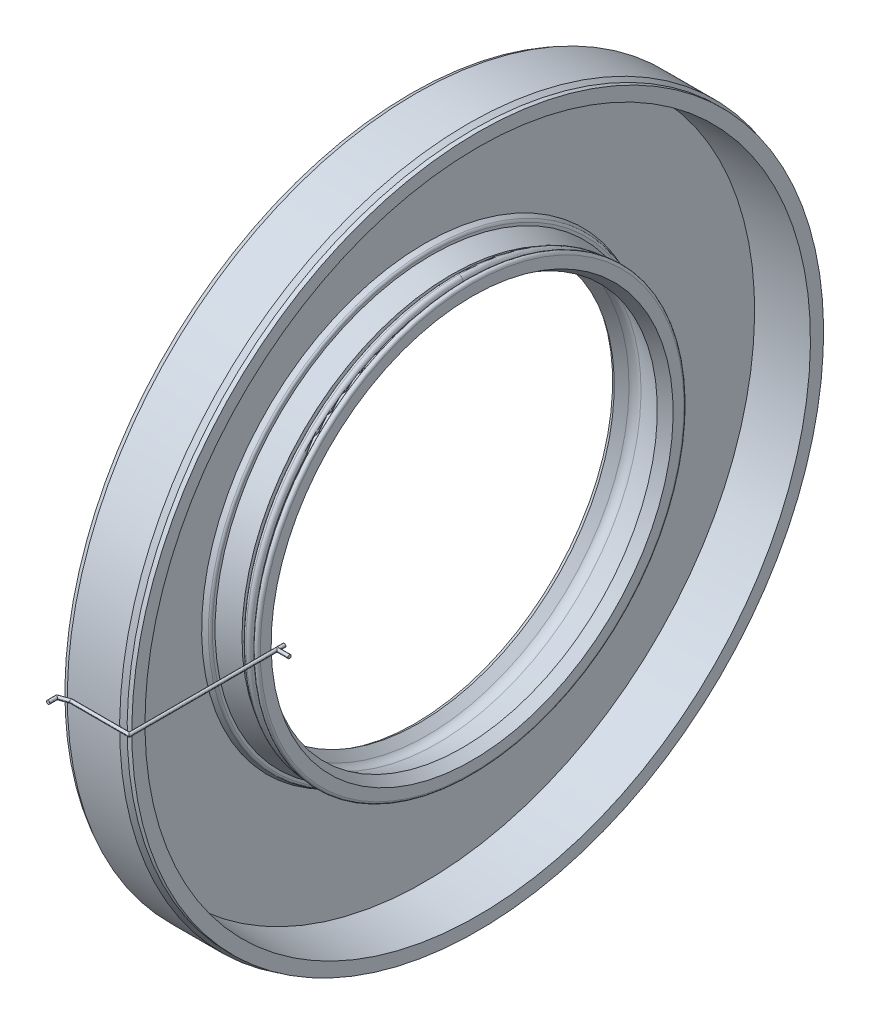
ISO-10303-21;
HEADER;
FILE_DESCRIPTION(('STEP AP214'),'2;1');
FILE_NAME('part.step','',(''),(''),'','','');
FILE_SCHEMA(('AUTOMOTIVE_DESIGN { 1 0 10303 214 1 1 1 1 }'));
ENDSEC;
DATA;
#1=APPLICATION_CONTEXT('core data for automotive mechanical design processes');
#2=APPLICATION_PROTOCOL_DEFINITION('international standard','automotive_design',2000,#1);
#3=PRODUCT_CONTEXT('',#1,'mechanical');
#4=PRODUCT('Part','Part','',(#3));
#5=PRODUCT_RELATED_PRODUCT_CATEGORY('part','',(#4));
#6=PRODUCT_DEFINITION_FORMATION('','',#4);
#7=PRODUCT_DEFINITION_CONTEXT('part definition',#1,'design');
#8=PRODUCT_DEFINITION('design','',#6,#7);
#9=PRODUCT_DEFINITION_SHAPE('','',#8);
#10=(LENGTH_UNIT() NAMED_UNIT(*) SI_UNIT(.MILLI.,.METRE.));
#11=(NAMED_UNIT(*) PLANE_ANGLE_UNIT() SI_UNIT($,.RADIAN.));
#12=(NAMED_UNIT(*) SI_UNIT($,.STERADIAN.) SOLID_ANGLE_UNIT());
#13=UNCERTAINTY_MEASURE_WITH_UNIT(LENGTH_MEASURE(1.E-05),#10,'distance_accuracy_value','');
#14=(GEOMETRIC_REPRESENTATION_CONTEXT(3) GLOBAL_UNCERTAINTY_ASSIGNED_CONTEXT((#13)) GLOBAL_UNIT_ASSIGNED_CONTEXT((#10,
#11,#12)) REPRESENTATION_CONTEXT('',''));
#15=CARTESIAN_POINT('',(0.,0.,0.));
#16=DIRECTION('',(0.,0.,1.));
#17=DIRECTION('',(1.,0.,0.));
#18=AXIS2_PLACEMENT_3D('',#15,#16,#17);
#19=CARTESIAN_POINT('',(-1.964337,38.001163,0.));
#20=DIRECTION('',(-1.,0.,0.));
#21=DIRECTION('',(0.,-1.,0.));
#22=AXIS2_PLACEMENT_3D('',#19,#20,#21);
#23=PLANE('',#22);
#24=CARTESIAN_POINT('',(-1.964337,0.,0.));
#25=DIRECTION('',(1.,0.,0.));
#26=DIRECTION('',(0.,1.,0.));
#27=AXIS2_PLACEMENT_3D('',#24,#25,#26);
#28=CIRCLE('',#27,37.566663);
#29=CARTESIAN_POINT('',(-1.964337,37.566663,0.));
#30=VERTEX_POINT('',#29);
#31=EDGE_CURVE('P0_E20',#30,#30,#28,.T.);
#32=ORIENTED_EDGE('',*,*,#31,.T.);
#33=EDGE_LOOP('',(#32));
#34=FACE_BOUND('',#33,.T.);
#35=CARTESIAN_POINT('',(-1.964337,0.,0.));
#36=DIRECTION('',(1.,0.,0.));
#37=DIRECTION('',(0.,1.,0.));
#38=AXIS2_PLACEMENT_3D('',#35,#36,#37);
#39=CIRCLE('',#38,38.001163);
#40=CARTESIAN_POINT('',(-1.964337,38.001163,0.));
#41=VERTEX_POINT('',#40);
#42=EDGE_CURVE('P0_E9',#41,#41,#39,.T.);
#43=ORIENTED_EDGE('',*,*,#42,.F.);
#44=EDGE_LOOP('',(#43));
#45=FACE_BOUND('',#44,.T.);
#46=ADVANCED_FACE('P0_F14',(#34,#45),#23,.T.);
#47=CARTESIAN_POINT('',(-3.339337,0.,0.));
#48=DIRECTION('',(1.,0.,0.));
#49=DIRECTION('',(0.,1.,0.));
#50=AXIS2_PLACEMENT_3D('',#47,#48,#49);
#51=TOROIDAL_SURFACE('',#50,37.566663,1.375);
#52=CARTESIAN_POINT('',(-4.714337,0.,0.));
#53=DIRECTION('',(1.,0.,0.));
#54=DIRECTION('',(0.,1.,0.));
#55=AXIS2_PLACEMENT_3D('',#52,#53,#54);
#56=CIRCLE('',#55,37.566663);
#57=CARTESIAN_POINT('',(-4.714337,37.566663,0.));
#58=VERTEX_POINT('',#57);
#59=EDGE_CURVE('P0_E24',#58,#58,#56,.T.);
#60=ORIENTED_EDGE('',*,*,#59,.T.);
#61=EDGE_LOOP('',(#60));
#62=FACE_BOUND('',#61,.T.);
#63=ORIENTED_EDGE('',*,*,#31,.F.);
#64=EDGE_LOOP('',(#63));
#65=FACE_BOUND('',#64,.T.);
#66=ADVANCED_FACE('P0_F122',(#62,#65),#51,.F.);
#67=CARTESIAN_POINT('',(-4.714337,0.,0.));
#68=DIRECTION('',(-1.,0.,0.));
#69=DIRECTION('',(0.,-1.,0.));
#70=AXIS2_PLACEMENT_3D('',#67,#68,#69);
#71=CONICAL_SURFACE('',#70,37.566663,0.327053895995008);
#72=CARTESIAN_POINT('',(-8.31960907968015,0.,0.));
#73=DIRECTION('',(1.,0.,0.));
#74=DIRECTION('',(0.,1.,0.));
#75=AXIS2_PLACEMENT_3D('',#72,#73,#74);
#76=CIRCLE('',#75,38.7897026144328);
#77=CARTESIAN_POINT('',(-8.31960907968015,38.7897026144328,0.));
#78=VERTEX_POINT('',#77);
#79=EDGE_CURVE('P0_E28',#78,#78,#76,.T.);
#80=ORIENTED_EDGE('',*,*,#79,.T.);
#81=EDGE_LOOP('',(#80));
#82=FACE_BOUND('',#81,.T.);
#83=ORIENTED_EDGE('',*,*,#59,.F.);
#84=EDGE_LOOP('',(#83));
#85=FACE_BOUND('',#84,.T.);
#86=ADVANCED_FACE('P0_F126',(#82,#85),#71,.T.);
#87=CARTESIAN_POINT('',(-8.31960907968015,39.2716858744327,0.));
#88=DIRECTION('',(1.,0.,0.));
#89=DIRECTION('',(0.,1.,0.));
#90=AXIS2_PLACEMENT_3D('',#87,#88,#89);
#91=PLANE('',#90);
#92=CARTESIAN_POINT('',(-8.31960907968015,0.,0.));
#93=DIRECTION('',(1.,0.,0.));
#94=DIRECTION('',(0.,1.,0.));
#95=AXIS2_PLACEMENT_3D('',#92,#93,#94);
#96=CIRCLE('',#95,39.2716858744327);
#97=CARTESIAN_POINT('',(-8.31960907968015,39.2716858744327,0.));
#98=VERTEX_POINT('',#97);
#99=EDGE_CURVE('P0_E33',#98,#98,#96,.T.);
#100=ORIENTED_EDGE('',*,*,#99,.T.);
#101=EDGE_LOOP('',(#100));
#102=FACE_BOUND('',#101,.T.);
#103=ORIENTED_EDGE('',*,*,#79,.F.);
#104=EDGE_LOOP('',(#103));
#105=FACE_BOUND('',#104,.T.);
#106=ADVANCED_FACE('P0_F132',(#102,#105),#91,.T.);
#107=CARTESIAN_POINT('',(-8.77794167968015,0.,0.));
#108=DIRECTION('',(1.,0.,0.));
#109=DIRECTION('',(0.,1.,0.));
#110=AXIS2_PLACEMENT_3D('',#107,#108,#109);
#111=TOROIDAL_SURFACE('',#110,39.2716858744327,0.4583326);
#112=CARTESIAN_POINT('',(-8.60576674,0.,0.));
#113=DIRECTION('',(1.,0.,0.));
#114=DIRECTION('',(0.,1.,0.));
#115=AXIS2_PLACEMENT_3D('',#112,#113,#114);
#116=CIRCLE('',#115,39.69645);
#117=CARTESIAN_POINT('',(-8.60576674,39.69645,0.));
#118=VERTEX_POINT('',#117);
#119=EDGE_CURVE('P0_E36',#118,#118,#116,.T.);
#120=ORIENTED_EDGE('',*,*,#119,.T.);
#121=EDGE_LOOP('',(#120));
#122=FACE_BOUND('',#121,.T.);
#123=ORIENTED_EDGE('',*,*,#99,.F.);
#124=EDGE_LOOP('',(#123));
#125=FACE_BOUND('',#124,.T.);
#126=ADVANCED_FACE('P0_F139',(#122,#125),#111,.T.);
#127=CARTESIAN_POINT('',(-8.60576674,0.,0.));
#128=DIRECTION('',(-1.,0.,0.));
#129=DIRECTION('',(0.,-1.,0.));
#130=AXIS2_PLACEMENT_3D('',#127,#128,#129);
#131=CONICAL_SURFACE('',#130,39.69645,0.385103453086037);
#132=CARTESIAN_POINT('',(-9.47,0.,0.));
#133=DIRECTION('',(1.,0.,0.));
#134=DIRECTION('',(0.,1.,0.));
#135=AXIS2_PLACEMENT_3D('',#132,#133,#134);
#136=CIRCLE('',#135,40.0467604439702);
#137=CARTESIAN_POINT('',(-9.47,40.0467604439702,0.));
#138=VERTEX_POINT('',#137);
#139=EDGE_CURVE('P0_E39',#138,#138,#136,.T.);
#140=ORIENTED_EDGE('',*,*,#139,.T.);
#141=EDGE_LOOP('',(#140));
#142=FACE_BOUND('',#141,.T.);
#143=ORIENTED_EDGE('',*,*,#119,.F.);
#144=EDGE_LOOP('',(#143));
#145=FACE_BOUND('',#144,.T.);
#146=ADVANCED_FACE('P0_F143',(#142,#145),#131,.T.);
#147=CARTESIAN_POINT('',(-9.47,59.1402501461873,0.));
#148=DIRECTION('',(1.,0.,0.));
#149=DIRECTION('',(0.,1.,0.));
#150=AXIS2_PLACEMENT_3D('',#147,#148,#149);
#151=PLANE('',#150);
#152=CARTESIAN_POINT('',(-9.47,0.,0.));
#153=DIRECTION('',(1.,0.,0.));
#154=DIRECTION('',(0.,1.,0.));
#155=AXIS2_PLACEMENT_3D('',#152,#153,#154);
#156=CIRCLE('',#155,59.1402501461873);
#157=CARTESIAN_POINT('',(-9.47,59.1402501461873,0.));
#158=VERTEX_POINT('',#157);
#159=EDGE_CURVE('P0_E42',#158,#158,#156,.T.);
#160=ORIENTED_EDGE('',*,*,#159,.T.);
#161=EDGE_LOOP('',(#160));
#162=FACE_BOUND('',#161,.T.);
#163=ORIENTED_EDGE('',*,*,#139,.F.);
#164=EDGE_LOOP('',(#163));
#165=FACE_BOUND('',#164,.T.);
#166=ADVANCED_FACE('P0_F147',(#162,#165),#151,.T.);
#167=CARTESIAN_POINT('',(-9.47,0.,0.));
#168=DIRECTION('',(1.,0.,0.));
#169=DIRECTION('',(0.,1.,0.));
#170=AXIS2_PLACEMENT_3D('',#167,#168,#169);
#171=CONICAL_SURFACE('',#170,59.1402501461873,0.0573559825776067);
#172=CARTESIAN_POINT('',(0.,0.,0.));
#173=DIRECTION('',(1.,0.,0.));
#174=DIRECTION('',(0.,1.,0.));
#175=AXIS2_PLACEMENT_3D('',#172,#173,#174);
#176=CIRCLE('',#175,59.6840077);
#177=CARTESIAN_POINT('',(0.,59.6840077,0.));
#178=VERTEX_POINT('',#177);
#179=EDGE_CURVE('P0_E45',#178,#178,#176,.T.);
#180=ORIENTED_EDGE('',*,*,#179,.T.);
#181=EDGE_LOOP('',(#180));
#182=FACE_BOUND('',#181,.T.);
#183=ORIENTED_EDGE('',*,*,#159,.F.);
#184=EDGE_LOOP('',(#183));
#185=FACE_BOUND('',#184,.T.);
#186=ADVANCED_FACE('P0_F151',(#182,#185),#171,.F.);
#187=CARTESIAN_POINT('',(0.,62.041674,0.));
#188=DIRECTION('',(1.,0.,0.));
#189=DIRECTION('',(0.,1.,0.));
#190=AXIS2_PLACEMENT_3D('',#187,#188,#189);
#191=PLANE('',#190);
#192=CARTESIAN_POINT('',(0.,0.,0.));
#193=DIRECTION('',(1.,0.,0.));
#194=DIRECTION('',(0.,1.,0.));
#195=AXIS2_PLACEMENT_3D('',#192,#193,#194);
#196=CIRCLE('',#195,62.041674);
#197=CARTESIAN_POINT('',(0.,62.041674,0.));
#198=VERTEX_POINT('',#197);
#199=EDGE_CURVE('P0_E48',#198,#198,#196,.T.);
#200=ORIENTED_EDGE('',*,*,#199,.T.);
#201=EDGE_LOOP('',(#200));
#202=FACE_BOUND('',#201,.T.);
#203=ORIENTED_EDGE('',*,*,#179,.F.);
#204=EDGE_LOOP('',(#203));
#205=FACE_BOUND('',#204,.T.);
#206=ADVANCED_FACE('P0_F155',(#202,#205),#191,.T.);
#207=CARTESIAN_POINT('',(0.6,0.,0.));
#208=DIRECTION('',(1.,0.,0.));
#209=DIRECTION('',(0.,1.,0.));
#210=AXIS2_PLACEMENT_3D('',#207,#208,#209);
#211=CYLINDRICAL_SURFACE('',#210,62.041674);
#212=CARTESIAN_POINT('',(-0.834,0.,0.));
#213=DIRECTION('',(1.,0.,0.));
#214=DIRECTION('',(0.,1.,0.));
#215=AXIS2_PLACEMENT_3D('',#212,#213,#214);
#216=CIRCLE('',#215,62.041674);
#217=CARTESIAN_POINT('',(-0.834,62.041674,0.));
#218=VERTEX_POINT('',#217);
#219=EDGE_CURVE('P0_E51',#218,#218,#216,.T.);
#220=ORIENTED_EDGE('',*,*,#219,.T.);
#221=EDGE_LOOP('',(#220));
#222=FACE_BOUND('',#221,.T.);
#223=ORIENTED_EDGE('',*,*,#199,.F.);
#224=EDGE_LOOP('',(#223));
#225=FACE_BOUND('',#224,.T.);
#226=ADVANCED_FACE('P0_F159',(#222,#225),#211,.T.);
#227=CARTESIAN_POINT('',(-0.834,0.,0.));
#228=DIRECTION('',(-1.,0.,0.));
#229=DIRECTION('',(0.,-1.,0.));
#230=AXIS2_PLACEMENT_3D('',#227,#228,#229);
#231=CONICAL_SURFACE('',#230,62.041674,0.47521465488341);
#232=CARTESIAN_POINT('',(-1.72474284,0.,0.));
#233=DIRECTION('',(1.,0.,0.));
#234=DIRECTION('',(0.,1.,0.));
#235=AXIS2_PLACEMENT_3D('',#232,#233,#234);
#236=CIRCLE('',#235,62.5);
#237=CARTESIAN_POINT('',(-1.72474284,62.5,0.));
#238=VERTEX_POINT('',#237);
#239=EDGE_CURVE('P0_E54',#238,#238,#236,.T.);
#240=ORIENTED_EDGE('',*,*,#239,.T.);
#241=EDGE_LOOP('',(#240));
#242=FACE_BOUND('',#241,.T.);
#243=ORIENTED_EDGE('',*,*,#219,.F.);
#244=EDGE_LOOP('',(#243));
#245=FACE_BOUND('',#244,.T.);
#246=ADVANCED_FACE('P0_F163',(#242,#245),#231,.T.);
#247=CARTESIAN_POINT('',(0.6,0.,0.));
#248=DIRECTION('',(1.,0.,0.));
#249=DIRECTION('',(0.,1.,0.));
#250=AXIS2_PLACEMENT_3D('',#247,#248,#249);
#251=CYLINDRICAL_SURFACE('',#250,62.5);
#252=CARTESIAN_POINT('',(-11.10925716,0.,0.));
#253=DIRECTION('',(1.,0.,0.));
#254=DIRECTION('',(0.,1.,0.));
#255=AXIS2_PLACEMENT_3D('',#252,#253,#254);
#256=CIRCLE('',#255,62.5);
#257=CARTESIAN_POINT('',(-11.10925716,62.5,0.));
#258=VERTEX_POINT('',#257);
#259=EDGE_CURVE('P0_E57',#258,#258,#256,.T.);
#260=ORIENTED_EDGE('',*,*,#259,.T.);
#261=EDGE_LOOP('',(#260));
#262=FACE_BOUND('',#261,.T.);
#263=ORIENTED_EDGE('',*,*,#239,.F.);
#264=EDGE_LOOP('',(#263));
#265=FACE_BOUND('',#264,.T.);
#266=ADVANCED_FACE('P0_F167',(#262,#265),#251,.T.);
#267=CARTESIAN_POINT('',(-11.10925716,0.,0.));
#268=DIRECTION('',(1.,0.,0.));
#269=DIRECTION('',(0.,1.,0.));
#270=AXIS2_PLACEMENT_3D('',#267,#268,#269);
#271=CONICAL_SURFACE('',#270,62.5,0.475214654883403);
#272=CARTESIAN_POINT('',(-12.,0.,0.));
#273=DIRECTION('',(1.,0.,0.));
#274=DIRECTION('',(0.,1.,0.));
#275=AXIS2_PLACEMENT_3D('',#272,#273,#274);
#276=CIRCLE('',#275,62.041674);
#277=CARTESIAN_POINT('',(-12.,62.041674,0.));
#278=VERTEX_POINT('',#277);
#279=EDGE_CURVE('P0_E60',#278,#278,#276,.T.);
#280=ORIENTED_EDGE('',*,*,#279,.T.);
#281=EDGE_LOOP('',(#280));
#282=FACE_BOUND('',#281,.T.);
#283=ORIENTED_EDGE('',*,*,#259,.F.);
#284=EDGE_LOOP('',(#283));
#285=FACE_BOUND('',#284,.T.);
#286=ADVANCED_FACE('P0_F171',(#282,#285),#271,.T.);
#287=CARTESIAN_POINT('',(-12.,59.613424,0.));
#288=DIRECTION('',(-1.,0.,0.));
#289=DIRECTION('',(0.,-1.,0.));
#290=AXIS2_PLACEMENT_3D('',#287,#288,#289);
#291=PLANE('',#290);
#292=CARTESIAN_POINT('',(-12.,0.,0.));
#293=DIRECTION('',(1.,0.,0.));
#294=DIRECTION('',(0.,1.,0.));
#295=AXIS2_PLACEMENT_3D('',#292,#293,#294);
#296=CIRCLE('',#295,59.613424);
#297=CARTESIAN_POINT('',(-12.,59.613424,0.));
#298=VERTEX_POINT('',#297);
#299=EDGE_CURVE('P0_E63',#298,#298,#296,.T.);
#300=ORIENTED_EDGE('',*,*,#299,.T.);
#301=EDGE_LOOP('',(#300));
#302=FACE_BOUND('',#301,.T.);
#303=ORIENTED_EDGE('',*,*,#279,.F.);
#304=EDGE_LOOP('',(#303));
#305=FACE_BOUND('',#304,.T.);
#306=ADVANCED_FACE('P0_F175',(#302,#305),#291,.T.);
#307=CARTESIAN_POINT('',(-12.,0.,0.));
#308=DIRECTION('',(-1.,0.,0.));
#309=DIRECTION('',(0.,-1.,0.));
#310=AXIS2_PLACEMENT_3D('',#307,#308,#309);
#311=CONICAL_SURFACE('',#310,59.613424,0.301266216998823);
#312=CARTESIAN_POINT('',(-11.68375,0.,0.));
#313=DIRECTION('',(1.,0.,0.));
#314=DIRECTION('',(0.,1.,0.));
#315=AXIS2_PLACEMENT_3D('',#312,#313,#314);
#316=CIRCLE('',#315,59.51515748);
#317=CARTESIAN_POINT('',(-11.68375,59.51515748,0.));
#318=VERTEX_POINT('',#317);
#319=EDGE_CURVE('P0_E66',#318,#318,#316,.T.);
#320=ORIENTED_EDGE('',*,*,#319,.T.);
#321=EDGE_LOOP('',(#320));
#322=FACE_BOUND('',#321,.T.);
#323=ORIENTED_EDGE('',*,*,#299,.F.);
#324=EDGE_LOOP('',(#323));
#325=FACE_BOUND('',#324,.T.);
#326=ADVANCED_FACE('P0_F179',(#322,#325),#311,.F.);
#327=CARTESIAN_POINT('',(-11.68375,38.6551166666667,0.));
#328=DIRECTION('',(-1.,0.,0.));
#329=DIRECTION('',(0.,-1.,0.));
#330=AXIS2_PLACEMENT_3D('',#327,#328,#329);
#331=PLANE('',#330);
#332=CARTESIAN_POINT('',(-11.68375,0.,0.));
#333=DIRECTION('',(1.,0.,0.));
#334=DIRECTION('',(0.,1.,0.));
#335=AXIS2_PLACEMENT_3D('',#332,#333,#334);
#336=CIRCLE('',#335,38.6551166666667);
#337=CARTESIAN_POINT('',(-11.68375,38.6551166666667,0.));
#338=VERTEX_POINT('',#337);
#339=EDGE_CURVE('P0_E69',#338,#338,#336,.T.);
#340=ORIENTED_EDGE('',*,*,#339,.T.);
#341=EDGE_LOOP('',(#340));
#342=FACE_BOUND('',#341,.T.);
#343=ORIENTED_EDGE('',*,*,#319,.F.);
#344=EDGE_LOOP('',(#343));
#345=FACE_BOUND('',#344,.T.);
#346=ADVANCED_FACE('P0_F183',(#342,#345),#331,.T.);
#347=CARTESIAN_POINT('',(-11.68375,0.,0.));
#348=DIRECTION('',(1.,0.,0.));
#349=DIRECTION('',(0.,1.,0.));
#350=AXIS2_PLACEMENT_3D('',#347,#348,#349);
#351=CONICAL_SURFACE('',#350,38.6551166666667,0.301266639932811);
#352=CARTESIAN_POINT('',(-12.0000011006089,0.,0.));
#353=DIRECTION('',(1.,0.,0.));
#354=DIRECTION('',(0.,1.,0.));
#355=AXIS2_PLACEMENT_3D('',#352,#353,#354);
#356=CIRCLE('',#355,38.5568496580137);
#357=CARTESIAN_POINT('',(-12.0000011006089,38.5568496580137,0.));
#358=VERTEX_POINT('',#357);
#359=EDGE_CURVE('P0_E72',#358,#358,#356,.T.);
#360=ORIENTED_EDGE('',*,*,#359,.T.);
#361=EDGE_LOOP('',(#360));
#362=FACE_BOUND('',#361,.T.);
#363=ORIENTED_EDGE('',*,*,#339,.F.);
#364=EDGE_LOOP('',(#363));
#365=FACE_BOUND('',#364,.T.);
#366=ADVANCED_FACE('P0_F187',(#362,#365),#351,.T.);
#367=CARTESIAN_POINT('',(-12.0000005503044,37.6745289964517,0.));
#368=DIRECTION('',(-1.,0.,0.));
#369=DIRECTION('',(0.,-1.,0.));
#370=AXIS2_PLACEMENT_3D('',#367,#368,#369);
#371=PLANE('',#370);
#372=CARTESIAN_POINT('',(-12.,0.,0.));
#373=DIRECTION('',(1.,0.,0.));
#374=DIRECTION('',(0.,1.,0.));
#375=AXIS2_PLACEMENT_3D('',#372,#373,#374);
#376=CIRCLE('',#375,37.6745289964517);
#377=CARTESIAN_POINT('',(-12.,37.6745289964517,0.));
#378=VERTEX_POINT('',#377);
#379=EDGE_CURVE('P0_E75',#378,#378,#376,.T.);
#380=ORIENTED_EDGE('',*,*,#379,.T.);
#381=EDGE_LOOP('',(#380));
#382=FACE_BOUND('',#381,.T.);
#383=ORIENTED_EDGE('',*,*,#359,.F.);
#384=EDGE_LOOP('',(#383));
#385=FACE_BOUND('',#384,.T.);
#386=ADVANCED_FACE('P0_F191',(#382,#385),#371,.T.);
#387=CARTESIAN_POINT('',(-11.63337,0.,0.));
#388=DIRECTION('',(1.,0.,0.));
#389=DIRECTION('',(0.,1.,0.));
#390=AXIS2_PLACEMENT_3D('',#387,#388,#389);
#391=TOROIDAL_SURFACE('',#390,37.6745289964517,0.36662999999993);
#392=CARTESIAN_POINT('',(-11.63337,0.,0.));
#393=DIRECTION('',(1.,0.,0.));
#394=DIRECTION('',(0.,1.,0.));
#395=AXIS2_PLACEMENT_3D('',#392,#393,#394);
#396=CIRCLE('',#395,37.3078989964517);
#397=CARTESIAN_POINT('',(-11.63337,37.3078989964517,0.));
#398=VERTEX_POINT('',#397);
#399=EDGE_CURVE('P0_E78',#398,#398,#396,.T.);
#400=ORIENTED_EDGE('',*,*,#399,.T.);
#401=EDGE_LOOP('',(#400));
#402=FACE_BOUND('',#401,.T.);
#403=ORIENTED_EDGE('',*,*,#379,.F.);
#404=EDGE_LOOP('',(#403));
#405=FACE_BOUND('',#404,.T.);
#406=ADVANCED_FACE('P0_F195',(#402,#405),#391,.T.);
#407=CARTESIAN_POINT('',(0.6,0.,0.));
#408=DIRECTION('',(1.,0.,0.));
#409=DIRECTION('',(0.,1.,0.));
#410=AXIS2_PLACEMENT_3D('',#407,#408,#409);
#411=CYLINDRICAL_SURFACE('',#410,37.3078989964517);
#412=CARTESIAN_POINT('',(-10.7152925611424,0.,0.));
#413=DIRECTION('',(1.,0.,0.));
#414=DIRECTION('',(0.,1.,0.));
#415=AXIS2_PLACEMENT_3D('',#412,#413,#414);
#416=CIRCLE('',#415,37.3078989964517);
#417=CARTESIAN_POINT('',(-10.7152925611424,37.3078989964517,0.));
#418=VERTEX_POINT('',#417);
#419=EDGE_CURVE('P0_E81',#418,#418,#416,.T.);
#420=ORIENTED_EDGE('',*,*,#419,.T.);
#421=EDGE_LOOP('',(#420));
#422=FACE_BOUND('',#421,.T.);
#423=ORIENTED_EDGE('',*,*,#399,.F.);
#424=EDGE_LOOP('',(#423));
#425=FACE_BOUND('',#424,.T.);
#426=ADVANCED_FACE('P0_F199',(#422,#425),#411,.F.);
#427=CARTESIAN_POINT('',(-10.7152925611424,0.,0.));
#428=DIRECTION('',(1.,0.,0.));
#429=DIRECTION('',(0.,1.,0.));
#430=AXIS2_PLACEMENT_3D('',#427,#428,#429);
#431=TOROIDAL_SURFACE('',#430,36.8495657364517,0.45833325999999);
#432=CARTESIAN_POINT('',(-10.3641888855394,0.,0.));
#433=DIRECTION('',(1.,0.,0.));
#434=DIRECTION('',(0.,1.,0.));
#435=AXIS2_PLACEMENT_3D('',#432,#433,#434);
#436=CIRCLE('',#435,36.55495483);
#437=CARTESIAN_POINT('',(-10.3641888855394,36.55495483,0.));
#438=VERTEX_POINT('',#437);
#439=EDGE_CURVE('P0_E84',#438,#438,#436,.T.);
#440=ORIENTED_EDGE('',*,*,#439,.T.);
#441=EDGE_LOOP('',(#440));
#442=FACE_BOUND('',#441,.T.);
#443=ORIENTED_EDGE('',*,*,#419,.F.);
#444=EDGE_LOOP('',(#443));
#445=FACE_BOUND('',#444,.T.);
#446=ADVANCED_FACE('P0_F203',(#442,#445),#431,.F.);
#447=CARTESIAN_POINT('',(-10.3641888855394,0.,0.));
#448=DIRECTION('',(1.,0.,0.));
#449=DIRECTION('',(0.,1.,0.));
#450=AXIS2_PLACEMENT_3D('',#447,#448,#449);
#451=CONICAL_SURFACE('',#450,36.55495483,0.872664723357459);
#452=CARTESIAN_POINT('',(-11.2707428855394,0.,0.));
#453=DIRECTION('',(1.,0.,0.));
#454=DIRECTION('',(0.,1.,0.));
#455=AXIS2_PLACEMENT_3D('',#452,#453,#454);
#456=CIRCLE('',#455,35.47456563);
#457=CARTESIAN_POINT('',(-11.2707428855394,35.47456563,0.));
#458=VERTEX_POINT('',#457);
#459=EDGE_CURVE('P0_E87',#458,#458,#456,.T.);
#460=ORIENTED_EDGE('',*,*,#459,.T.);
#461=EDGE_LOOP('',(#460));
#462=FACE_BOUND('',#461,.T.);
#463=ORIENTED_EDGE('',*,*,#439,.F.);
#464=EDGE_LOOP('',(#463));
#465=FACE_BOUND('',#464,.T.);
#466=ADVANCED_FACE('P0_F207',(#462,#465),#451,.T.);
#467=CARTESIAN_POINT('',(-11.2707428855394,0.,0.));
#468=DIRECTION('',(-1.,0.,0.));
#469=DIRECTION('',(0.,-1.,0.));
#470=AXIS2_PLACEMENT_3D('',#467,#468,#469);
#471=CONICAL_SURFACE('',#470,35.47456563,0.555416856137234);
#472=CARTESIAN_POINT('',(-10.5060338855394,0.,0.));
#473=DIRECTION('',(1.,0.,0.));
#474=DIRECTION('',(0.,1.,0.));
#475=AXIS2_PLACEMENT_3D('',#472,#473,#474);
#476=CIRCLE('',#475,35.0000001);
#477=CARTESIAN_POINT('',(-10.5060338855394,35.0000001,0.));
#478=VERTEX_POINT('',#477);
#479=EDGE_CURVE('P0_E90',#478,#478,#476,.T.);
#480=ORIENTED_EDGE('',*,*,#479,.T.);
#481=EDGE_LOOP('',(#480));
#482=FACE_BOUND('',#481,.T.);
#483=ORIENTED_EDGE('',*,*,#459,.F.);
#484=EDGE_LOOP('',(#483));
#485=FACE_BOUND('',#484,.T.);
#486=ADVANCED_FACE('P0_F211',(#482,#485),#471,.F.);
#487=CARTESIAN_POINT('',(-10.5060338855394,0.,0.));
#488=DIRECTION('',(1.,0.,0.));
#489=DIRECTION('',(0.,1.,0.));
#490=AXIS2_PLACEMENT_3D('',#487,#488,#489);
#491=CONICAL_SURFACE('',#490,35.0000001,0.717627486920525);
#492=CARTESIAN_POINT('',(-9.09434801301688,0.,0.));
#493=DIRECTION('',(1.,0.,0.));
#494=DIRECTION('',(0.,1.,0.));
#495=AXIS2_PLACEMENT_3D('',#492,#493,#494);
#496=CIRCLE('',#495,36.2322311150568);
#497=CARTESIAN_POINT('',(-9.09434801301688,36.2322311150568,0.));
#498=VERTEX_POINT('',#497);
#499=EDGE_CURVE('P0_E93',#498,#498,#496,.T.);
#500=ORIENTED_EDGE('',*,*,#499,.T.);
#501=EDGE_LOOP('',(#500));
#502=FACE_BOUND('',#501,.T.);
#503=ORIENTED_EDGE('',*,*,#479,.F.);
#504=EDGE_LOOP('',(#503));
#505=FACE_BOUND('',#504,.T.);
#506=ADVANCED_FACE('P0_F215',(#502,#505),#491,.F.);
#507=CARTESIAN_POINT('',(-7.88875,0.,0.));
#508=DIRECTION('',(1.,0.,0.));
#509=DIRECTION('',(0.,1.,0.));
#510=AXIS2_PLACEMENT_3D('',#507,#508,#509);
#511=TOROIDAL_SURFACE('',#510,34.85105703,1.83333259999998);
#512=CARTESIAN_POINT('',(-7.28126530844351,0.,0.));
#513=DIRECTION('',(1.,0.,0.));
#514=DIRECTION('',(0.,1.,0.));
#515=AXIS2_PLACEMENT_3D('',#512,#513,#514);
#516=CIRCLE('',#515,36.5808173520525);
#517=CARTESIAN_POINT('',(-7.28126530844351,36.5808173520525,0.));
#518=VERTEX_POINT('',#517);
#519=EDGE_CURVE('P0_E96',#518,#518,#516,.T.);
#520=ORIENTED_EDGE('',*,*,#519,.T.);
#521=EDGE_LOOP('',(#520));
#522=FACE_BOUND('',#521,.T.);
#523=ORIENTED_EDGE('',*,*,#499,.F.);
#524=EDGE_LOOP('',(#523));
#525=FACE_BOUND('',#524,.T.);
#526=ADVANCED_FACE('P0_F219',(#522,#525),#511,.F.);
#527=CARTESIAN_POINT('',(-7.28126530844351,0.,0.));
#528=DIRECTION('',(-1.,0.,0.));
#529=DIRECTION('',(0.,-1.,0.));
#530=AXIS2_PLACEMENT_3D('',#527,#528,#529);
#531=CONICAL_SURFACE('',#530,36.5808173520525,0.337739770467445);
#532=CARTESIAN_POINT('',(-2.78002409199999,0.,0.));
#533=DIRECTION('',(1.,0.,0.));
#534=DIRECTION('',(0.,1.,0.));
#535=AXIS2_PLACEMENT_3D('',#532,#533,#534);
#536=CIRCLE('',#535,35.0000001);
#537=CARTESIAN_POINT('',(-2.78002409199999,35.0000001,0.));
#538=VERTEX_POINT('',#537);
#539=EDGE_CURVE('P0_E99',#538,#538,#536,.T.);
#540=ORIENTED_EDGE('',*,*,#539,.T.);
#541=EDGE_LOOP('',(#540));
#542=FACE_BOUND('',#541,.T.);
#543=ORIENTED_EDGE('',*,*,#519,.F.);
#544=EDGE_LOOP('',(#543));
#545=FACE_BOUND('',#544,.T.);
#546=ADVANCED_FACE('P0_F223',(#542,#545),#531,.F.);
#547=CARTESIAN_POINT('',(-2.78002409199999,0.,0.));
#548=DIRECTION('',(1.,0.,0.));
#549=DIRECTION('',(0.,1.,0.));
#550=AXIS2_PLACEMENT_3D('',#547,#548,#549);
#551=CONICAL_SURFACE('',#550,35.0000001,0.535441447537104);
#552=CARTESIAN_POINT('',(-1.0000044,0.,0.));
#553=DIRECTION('',(1.,0.,0.));
#554=DIRECTION('',(0.,1.,0.));
#555=AXIS2_PLACEMENT_3D('',#552,#553,#554);
#556=CIRCLE('',#555,36.0559967);
#557=CARTESIAN_POINT('',(-1.0000044,36.0559967,0.));
#558=VERTEX_POINT('',#557);
#559=EDGE_CURVE('P0_E102',#558,#558,#556,.T.);
#560=ORIENTED_EDGE('',*,*,#559,.T.);
#561=EDGE_LOOP('',(#560));
#562=FACE_BOUND('',#561,.T.);
#563=ORIENTED_EDGE('',*,*,#539,.F.);
#564=EDGE_LOOP('',(#563));
#565=FACE_BOUND('',#564,.T.);
#566=ADVANCED_FACE('P0_F119',(#562,#565),#551,.F.);
#567=CARTESIAN_POINT('',(-1.0000044,38.001163,0.));
#568=DIRECTION('',(1.,0.,0.));
#569=DIRECTION('',(0.,1.,0.));
#570=AXIS2_PLACEMENT_3D('',#567,#568,#569);
#571=PLANE('',#570);
#572=CARTESIAN_POINT('',(-1.0000044,0.,0.));
#573=DIRECTION('',(1.,0.,0.));
#574=DIRECTION('',(0.,1.,0.));
#575=AXIS2_PLACEMENT_3D('',#572,#573,#574);
#576=CIRCLE('',#575,38.001163);
#577=CARTESIAN_POINT('',(-1.0000044,38.001163,0.));
#578=VERTEX_POINT('',#577);
#579=EDGE_CURVE('P0_E105',#578,#578,#576,.T.);
#580=ORIENTED_EDGE('',*,*,#579,.T.);
#581=EDGE_LOOP('',(#580));
#582=FACE_BOUND('',#581,.T.);
#583=ORIENTED_EDGE('',*,*,#559,.F.);
#584=EDGE_LOOP('',(#583));
#585=FACE_BOUND('',#584,.T.);
#586=ADVANCED_FACE('P0_F109',(#582,#585),#571,.T.);
#587=CARTESIAN_POINT('',(-1.4821707,0.,0.));
#588=DIRECTION('',(1.,0.,0.));
#589=DIRECTION('',(0.,1.,0.));
#590=AXIS2_PLACEMENT_3D('',#587,#588,#589);
#591=TOROIDAL_SURFACE('',#590,38.001163,0.4821663);
#592=ORIENTED_EDGE('',*,*,#42,.T.);
#593=EDGE_LOOP('',(#592));
#594=FACE_BOUND('',#593,.T.);
#595=ORIENTED_EDGE('',*,*,#579,.F.);
#596=EDGE_LOOP('',(#595));
#597=FACE_BOUND('',#596,.T.);
#598=ADVANCED_FACE('P0_F112',(#594,#597),#591,.T.);
#599=CLOSED_SHELL('',(#46,#66,#86,#106,#126,#146,#166,#186,#206,#226,#246,#266,#286,#306,#326,
#346,#366,#386,#406,#426,#446,#466,#486,#506,#526,#546,#566,#586,#598));
#600=MANIFOLD_SOLID_BREP('P0_B1',#599);
#601=CARTESIAN_POINT('',(-3.339337,0.,0.));
#602=DIRECTION('',(1.,0.,0.));
#603=DIRECTION('',(0.,1.,0.));
#604=AXIS2_PLACEMENT_3D('',#601,#602,#603);
#605=TOROIDAL_SURFACE('',#604,37.566663,0.6875);
#606=CARTESIAN_POINT('',(-3.339337,0.,0.));
#607=DIRECTION('',(1.,0.,0.));
#608=DIRECTION('',(0.,1.,0.));
#609=AXIS2_PLACEMENT_3D('',#606,#607,#608);
#610=CIRCLE('',#609,36.879163);
#611=CARTESIAN_POINT('',(-3.339337,-36.879163,0.));
#612=VERTEX_POINT('',#611);
#613=CARTESIAN_POINT('',(-3.339337,36.879163,0.));
#614=VERTEX_POINT('',#613);
#615=EDGE_CURVE('P1_E34',#612,#614,#610,.F.);
#616=ORIENTED_EDGE('',*,*,#615,.T.);
#617=CARTESIAN_POINT('',(-3.339337,37.566663,0.));
#618=DIRECTION('',(0.,0.,-1.));
#619=DIRECTION('',(0.,-1.,0.));
#620=AXIS2_PLACEMENT_3D('',#617,#618,#619);
#621=CIRCLE('',#620,0.6875);
#622=CARTESIAN_POINT('',(-3.339337,38.254163,0.));
#623=VERTEX_POINT('',#622);
#624=EDGE_CURVE('P1_E54',#614,#623,#621,.F.);
#625=ORIENTED_EDGE('',*,*,#624,.T.);
#626=CARTESIAN_POINT('',(-3.339337,0.,0.));
#627=DIRECTION('',(1.,0.,0.));
#628=DIRECTION('',(0.,1.,0.));
#629=AXIS2_PLACEMENT_3D('',#626,#627,#628);
#630=CIRCLE('',#629,38.254163);
#631=CARTESIAN_POINT('',(-3.339337,-38.254163,0.));
#632=VERTEX_POINT('',#631);
#633=EDGE_CURVE('P1_E47',#623,#632,#630,.T.);
#634=ORIENTED_EDGE('',*,*,#633,.T.);
#635=CARTESIAN_POINT('',(-3.339337,-37.566663,0.));
#636=DIRECTION('',(0.,0.,1.));
#637=DIRECTION('',(0.,1.,0.));
#638=AXIS2_PLACEMENT_3D('',#635,#636,#637);
#639=CIRCLE('',#638,0.6875);
#640=EDGE_CURVE('P1_E43',#632,#612,#639,.T.);
#641=ORIENTED_EDGE('',*,*,#640,.T.);
#642=EDGE_LOOP('',(#616,#625,#634,#641));
#643=FACE_BOUND('',#642,.T.);
#644=ADVANCED_FACE('P1_F17',(#643),#605,.T.);
#645=CARTESIAN_POINT('',(-3.339337,0.,0.));
#646=DIRECTION('',(1.,0.,0.));
#647=DIRECTION('',(0.,1.,0.));
#648=AXIS2_PLACEMENT_3D('',#645,#646,#647);
#649=TOROIDAL_SURFACE('',#648,37.566663,0.6875);
#650=CARTESIAN_POINT('',(-3.339337,0.,0.));
#651=DIRECTION('',(1.,0.,0.));
#652=DIRECTION('',(0.,1.,0.));
#653=AXIS2_PLACEMENT_3D('',#650,#651,#652);
#654=CIRCLE('',#653,36.879163);
#655=EDGE_CURVE('P1_E26',#614,#612,#654,.F.);
#656=ORIENTED_EDGE('',*,*,#655,.T.);
#657=ORIENTED_EDGE('',*,*,#640,.F.);
#658=CARTESIAN_POINT('',(-3.339337,0.,0.));
#659=DIRECTION('',(1.,0.,0.));
#660=DIRECTION('',(0.,1.,0.));
#661=AXIS2_PLACEMENT_3D('',#658,#659,#660);
#662=CIRCLE('',#661,38.254163);
#663=EDGE_CURVE('P1_E60',#632,#623,#662,.T.);
#664=ORIENTED_EDGE('',*,*,#663,.T.);
#665=ORIENTED_EDGE('',*,*,#624,.F.);
#666=EDGE_LOOP('',(#656,#657,#664,#665));
#667=FACE_BOUND('',#666,.T.);
#668=ADVANCED_FACE('P1_F62',(#667),#649,.T.);
#669=CARTESIAN_POINT('',(-3.339337,0.,0.));
#670=DIRECTION('',(1.,0.,0.));
#671=DIRECTION('',(0.,1.,0.));
#672=AXIS2_PLACEMENT_3D('',#669,#670,#671);
#673=TOROIDAL_SURFACE('',#672,37.566663,0.6875);
#674=ORIENTED_EDGE('',*,*,#615,.F.);
#675=CARTESIAN_POINT('',(-3.339337,-37.566663,0.));
#676=DIRECTION('',(0.,0.,1.));
#677=DIRECTION('',(0.,1.,0.));
#678=AXIS2_PLACEMENT_3D('',#675,#676,#677);
#679=CIRCLE('',#678,0.6875);
#680=EDGE_CURVE('P1_E11',#612,#632,#679,.T.);
#681=ORIENTED_EDGE('',*,*,#680,.T.);
#682=ORIENTED_EDGE('',*,*,#633,.F.);
#683=CARTESIAN_POINT('',(-3.339337,37.566663,0.));
#684=DIRECTION('',(0.,0.,-1.));
#685=DIRECTION('',(0.,-1.,0.));
#686=AXIS2_PLACEMENT_3D('',#683,#684,#685);
#687=CIRCLE('',#686,0.6875);
#688=EDGE_CURVE('P1_E51',#623,#614,#687,.F.);
#689=ORIENTED_EDGE('',*,*,#688,.T.);
#690=EDGE_LOOP('',(#674,#681,#682,#689));
#691=FACE_BOUND('',#690,.T.);
#692=ADVANCED_FACE('P1_F49',(#691),#673,.T.);
#693=CARTESIAN_POINT('',(-3.339337,0.,0.));
#694=DIRECTION('',(1.,0.,0.));
#695=DIRECTION('',(0.,1.,0.));
#696=AXIS2_PLACEMENT_3D('',#693,#694,#695);
#697=TOROIDAL_SURFACE('',#696,37.566663,0.6875);
#698=ORIENTED_EDGE('',*,*,#655,.F.);
#699=ORIENTED_EDGE('',*,*,#688,.F.);
#700=ORIENTED_EDGE('',*,*,#663,.F.);
#701=ORIENTED_EDGE('',*,*,#680,.F.);
#702=EDGE_LOOP('',(#698,#699,#700,#701));
#703=FACE_BOUND('',#702,.T.);
#704=ADVANCED_FACE('P1_F59',(#703),#697,.T.);
#705=CLOSED_SHELL('',(#644,#668,#692,#704));
#706=MANIFOLD_SOLID_BREP('P1_B1',#705);
#707=CARTESIAN_POINT('',(-12.,0.,65.05));
#708=DIRECTION('',(0.,0.,1.));
#709=DIRECTION('',(1.,0.,0.));
#710=AXIS2_PLACEMENT_3D('',#707,#708,#709);
#711=CYLINDRICAL_SURFACE('',#710,0.3);
#712=CARTESIAN_POINT('',(-12.,0.,63.474399753422));
#713=DIRECTION('',(0.573576436351042,0.,-0.819152044288995));
#714=DIRECTION('',(0.819152044288995,0.,0.573576436351042));
#715=AXIS2_PLACEMENT_3D('',#712,#713,#714);
#716=ELLIPSE('',#715,0.366232376628451,0.300000000000013);
#717=CARTESIAN_POINT('',(-12.,-0.300000000000013,63.4743997534219));
#718=VERTEX_POINT('',#717);
#719=CARTESIAN_POINT('',(-12.3,0.,63.2643374919591));
#720=VERTEX_POINT('',#719);
#721=EDGE_CURVE('P2_E105',#718,#720,#716,.T.);
#722=ORIENTED_EDGE('',*,*,#721,.F.);
#723=CARTESIAN_POINT('',(-12.,0.,63.474399753422));
#724=DIRECTION('',(-0.573576436351042,0.,0.819152044288995));
#725=DIRECTION('',(0.819152044288995,0.,0.573576436351042));
#726=AXIS2_PLACEMENT_3D('',#723,#724,#725);
#727=ELLIPSE('',#726,0.366232376628451,0.300000000000013);
#728=CARTESIAN_POINT('',(-11.7,0.,63.6844620148849));
#729=VERTEX_POINT('',#728);
#730=EDGE_CURVE('P2_E84',#729,#718,#727,.F.);
#731=ORIENTED_EDGE('',*,*,#730,.F.);
#732=DIRECTION('',(0.,0.,-1.));
#733=VECTOR('',#732,1.);
#734=CARTESIAN_POINT('',(-11.7,0.,64.1571687459795));
#735=LINE('',#734,#733);
#736=CARTESIAN_POINT('',(-11.7,0.,65.05));
#737=VERTEX_POINT('',#736);
#738=EDGE_CURVE('P2_E82',#737,#729,#735,.T.);
#739=ORIENTED_EDGE('',*,*,#738,.F.);
#740=CARTESIAN_POINT('',(-12.,0.,65.05));
#741=DIRECTION('',(0.,0.,1.));
#742=DIRECTION('',(1.,0.,0.));
#743=AXIS2_PLACEMENT_3D('',#740,#741,#742);
#744=CIRCLE('',#743,0.3);
#745=CARTESIAN_POINT('',(-12.3,0.,65.05));
#746=VERTEX_POINT('',#745);
#747=EDGE_CURVE('P2_E20',#746,#737,#744,.T.);
#748=ORIENTED_EDGE('',*,*,#747,.F.);
#749=DIRECTION('',(0.,0.,1.));
#750=VECTOR('',#749,1.);
#751=CARTESIAN_POINT('',(-12.3,0.,64.1571687459795));
#752=LINE('',#751,#750);
#753=EDGE_CURVE('P2_E88',#720,#746,#752,.T.);
#754=ORIENTED_EDGE('',*,*,#753,.F.);
#755=EDGE_LOOP('',(#722,#731,#739,#748,#754));
#756=FACE_BOUND('',#755,.T.);
#757=ADVANCED_FACE('P2_F17',(#756),#711,.T.);
#758=CARTESIAN_POINT('',(-12.3,-0.303604214851137,65.05));
#759=DIRECTION('',(0.,0.,1.));
#760=DIRECTION('',(1.,0.,0.));
#761=AXIS2_PLACEMENT_3D('',#758,#759,#760);
#762=PLANE('',#761);
#763=CARTESIAN_POINT('',(-12.,0.,65.05));
#764=DIRECTION('',(0.,0.,1.));
#765=DIRECTION('',(1.,0.,0.));
#766=AXIS2_PLACEMENT_3D('',#763,#764,#765);
#767=CIRCLE('',#766,0.3);
#768=EDGE_CURVE('P2_E92',#746,#737,#767,.F.);
#769=ORIENTED_EDGE('',*,*,#768,.F.);
#770=ORIENTED_EDGE('',*,*,#747,.T.);
#771=EDGE_LOOP('',(#769,#770));
#772=FACE_BOUND('',#771,.T.);
#773=ADVANCED_FACE('P2_F91',(#772),#762,.T.);
#774=CARTESIAN_POINT('',(-12.,0.,65.05));
#775=DIRECTION('',(0.,0.,1.));
#776=DIRECTION('',(1.,0.,0.));
#777=AXIS2_PLACEMENT_3D('',#774,#775,#776);
#778=CYLINDRICAL_SURFACE('',#777,0.3);
#779=ORIENTED_EDGE('',*,*,#753,.T.);
#780=ORIENTED_EDGE('',*,*,#768,.T.);
#781=ORIENTED_EDGE('',*,*,#738,.T.);
#782=CARTESIAN_POINT('',(-12.,0.,63.474399753422));
#783=DIRECTION('',(-0.573576436351042,0.,0.819152044288995));
#784=DIRECTION('',(0.819152044288995,0.,0.573576436351042));
#785=AXIS2_PLACEMENT_3D('',#782,#783,#784);
#786=ELLIPSE('',#785,0.366232376628451,0.300000000000013);
#787=CARTESIAN_POINT('',(-12.,0.300000000000013,63.4743997534219));
#788=VERTEX_POINT('',#787);
#789=EDGE_CURVE('P2_E112',#788,#729,#786,.F.);
#790=ORIENTED_EDGE('',*,*,#789,.F.);
#791=CARTESIAN_POINT('',(-12.,0.,63.474399753422));
#792=DIRECTION('',(0.573576436351042,0.,-0.819152044288995));
#793=DIRECTION('',(0.819152044288995,0.,0.573576436351042));
#794=AXIS2_PLACEMENT_3D('',#791,#792,#793);
#795=ELLIPSE('',#794,0.366232376628451,0.300000000000013);
#796=EDGE_CURVE('P2_E109',#720,#788,#795,.T.);
#797=ORIENTED_EDGE('',*,*,#796,.F.);
#798=EDGE_LOOP('',(#779,#780,#781,#790,#797));
#799=FACE_BOUND('',#798,.T.);
#800=ADVANCED_FACE('P2_F94',(#799),#778,.T.);
#801=CARTESIAN_POINT('',(-10.0847939570023,0.,62.777321761284));
#802=DIRECTION('',(0.939692620785905,0.,-0.342020143325678));
#803=DIRECTION('',(-0.342020143325678,0.,-0.939692620785905));
#804=AXIS2_PLACEMENT_3D('',#801,#802,#803);
#805=CYLINDRICAL_SURFACE('',#804,0.300000000000026);
#806=ORIENTED_EDGE('',*,*,#730,.T.);
#807=ORIENTED_EDGE('',*,*,#721,.T.);
#808=DIRECTION('',(-0.93969262078591,0.,0.342020143325665));
#809=VECTOR('',#808,1.);
#810=CARTESIAN_POINT('',(-11.2708025167977,0.,62.8897402428917));
#811=LINE('',#810,#809);
#812=CARTESIAN_POINT('',(-10.2,0.,62.5));
#813=VERTEX_POINT('',#812);
#814=EDGE_CURVE('P2_E108',#813,#720,#811,.T.);
#815=ORIENTED_EDGE('',*,*,#814,.F.);
#816=CARTESIAN_POINT('',(-10.1471019057874,0.,62.8));
#817=DIRECTION('',(0.984807753012207,0.,-0.173648177666936));
#818=DIRECTION('',(-0.173648177666935,0.,-0.984807753012207));
#819=AXIS2_PLACEMENT_3D('',#816,#817,#818);
#820=ELLIPSE('',#819,0.304627983565735,0.30000000000001);
#821=CARTESIAN_POINT('',(-10.1471019057875,-0.30000000000001,62.8));
#822=VERTEX_POINT('',#821);
#823=EDGE_CURVE('P2_E95',#813,#822,#820,.F.);
#824=ORIENTED_EDGE('',*,*,#823,.T.);
#825=CARTESIAN_POINT('',(-10.1471019057874,0.,62.8));
#826=DIRECTION('',(0.984807753012207,0.,-0.173648177666936));
#827=DIRECTION('',(-0.173648177666935,0.,-0.984807753012207));
#828=AXIS2_PLACEMENT_3D('',#825,#826,#827);
#829=ELLIPSE('',#828,0.304627983565735,0.30000000000001);
#830=CARTESIAN_POINT('',(-10.0942038115749,0.,63.1));
#831=VERTEX_POINT('',#830);
#832=EDGE_CURVE('P2_E97',#822,#831,#829,.F.);
#833=ORIENTED_EDGE('',*,*,#832,.T.);
#834=DIRECTION('',(-0.939692620785917,0.,0.342020143325644));
#835=VECTOR('',#834,1.);
#836=CARTESIAN_POINT('',(-11.0655904308023,0.,63.4535558153632));
#837=LINE('',#836,#835);
#838=EDGE_CURVE('P2_E103',#831,#729,#837,.T.);
#839=ORIENTED_EDGE('',*,*,#838,.T.);
#840=EDGE_LOOP('',(#806,#807,#815,#824,#833,#839));
#841=FACE_BOUND('',#840,.T.);
#842=ADVANCED_FACE('P2_F271',(#841),#805,.T.);
#843=CARTESIAN_POINT('',(-10.0847939570023,0.,62.777321761284));
#844=DIRECTION('',(0.939692620785905,0.,-0.342020143325678));
#845=DIRECTION('',(-0.342020143325678,0.,-0.939692620785905));
#846=AXIS2_PLACEMENT_3D('',#843,#844,#845);
#847=CYLINDRICAL_SURFACE('',#846,0.300000000000026);
#848=CARTESIAN_POINT('',(-10.1471019057874,0.,62.8));
#849=DIRECTION('',(0.984807753012207,0.,-0.173648177666936));
#850=DIRECTION('',(0.173648177666935,0.,0.984807753012207));
#851=AXIS2_PLACEMENT_3D('',#848,#849,#850);
#852=ELLIPSE('',#851,0.304627983565735,0.30000000000001);
#853=CARTESIAN_POINT('',(-10.1471019057875,0.30000000000001,62.8));
#854=VERTEX_POINT('',#853);
#855=EDGE_CURVE('P2_E123',#854,#831,#852,.T.);
#856=ORIENTED_EDGE('',*,*,#855,.F.);
#857=CARTESIAN_POINT('',(-10.1471019057874,0.,62.8));
#858=DIRECTION('',(0.984807753012207,0.,-0.173648177666936));
#859=DIRECTION('',(0.173648177666935,0.,0.984807753012207));
#860=AXIS2_PLACEMENT_3D('',#857,#858,#859);
#861=ELLIPSE('',#860,0.304627983565735,0.30000000000001);
#862=EDGE_CURVE('P2_E120',#813,#854,#861,.T.);
#863=ORIENTED_EDGE('',*,*,#862,.F.);
#864=ORIENTED_EDGE('',*,*,#814,.T.);
#865=ORIENTED_EDGE('',*,*,#796,.T.);
#866=ORIENTED_EDGE('',*,*,#789,.T.);
#867=ORIENTED_EDGE('',*,*,#838,.F.);
#868=EDGE_LOOP('',(#856,#863,#864,#865,#866,#867));
#869=FACE_BOUND('',#868,.T.);
#870=ADVANCED_FACE('P2_F261',(#869),#847,.T.);
#871=CARTESIAN_POINT('',(2.55,-0.303604214851131,36.6));
#872=DIRECTION('',(1.,0.,0.));
#873=DIRECTION('',(0.,0.,-1.));
#874=AXIS2_PLACEMENT_3D('',#871,#872,#873);
#875=PLANE('',#874);
#876=CARTESIAN_POINT('',(2.55,0.,36.3));
#877=DIRECTION('',(1.,0.,0.));
#878=DIRECTION('',(0.,1.,0.));
#879=AXIS2_PLACEMENT_3D('',#876,#877,#878);
#880=CIRCLE('',#879,0.299999999999994);
#881=CARTESIAN_POINT('',(2.55,0.,36.6));
#882=VERTEX_POINT('',#881);
#883=CARTESIAN_POINT('',(2.55,0.,36.));
#884=VERTEX_POINT('',#883);
#885=EDGE_CURVE('P2_E117',#882,#884,#880,.F.);
#886=ORIENTED_EDGE('',*,*,#885,.F.);
#887=CARTESIAN_POINT('',(2.55,0.,36.3));
#888=DIRECTION('',(1.,0.,0.));
#889=DIRECTION('',(0.,1.,0.));
#890=AXIS2_PLACEMENT_3D('',#887,#888,#889);
#891=CIRCLE('',#890,0.299999999999994);
#892=EDGE_CURVE('P2_E133',#884,#882,#891,.F.);
#893=ORIENTED_EDGE('',*,*,#892,.F.);
#894=EDGE_LOOP('',(#886,#893));
#895=FACE_BOUND('',#894,.T.);
#896=ADVANCED_FACE('P2_F252',(#895),#875,.T.);
#897=CARTESIAN_POINT('',(2.55,0.,36.3));
#898=DIRECTION('',(1.,0.,0.));
#899=DIRECTION('',(0.,1.,0.));
#900=AXIS2_PLACEMENT_3D('',#897,#898,#899);
#901=CYLINDRICAL_SURFACE('',#900,0.299999999999994);
#902=DIRECTION('',(-1.,0.,0.));
#903=VECTOR('',#902,1.);
#904=CARTESIAN_POINT('',(1.425,0.,36.6));
#905=LINE('',#904,#903);
#906=CARTESIAN_POINT('',(0.6,0.,36.6));
#907=VERTEX_POINT('',#906);
#908=EDGE_CURVE('P2_E136',#882,#907,#905,.T.);
#909=ORIENTED_EDGE('',*,*,#908,.F.);
#910=ORIENTED_EDGE('',*,*,#885,.T.);
#911=DIRECTION('',(1.,0.,0.));
#912=VECTOR('',#911,1.);
#913=CARTESIAN_POINT('',(1.425,0.,36.));
#914=LINE('',#913,#912);
#915=CARTESIAN_POINT('',(0.6,0.,36.));
#916=VERTEX_POINT('',#915);
#917=EDGE_CURVE('P2_E132',#916,#884,#914,.T.);
#918=ORIENTED_EDGE('',*,*,#917,.F.);
#919=CARTESIAN_POINT('',(0.3,0.,36.3));
#920=DIRECTION('',(0.707106781186548,0.,0.707106781186548));
#921=DIRECTION('',(-0.707106781186548,0.,0.707106781186548));
#922=AXIS2_PLACEMENT_3D('',#919,#920,#921);
#923=ELLIPSE('',#922,0.424264068711925,0.3);
#924=CARTESIAN_POINT('',(0.3,0.299999999999996,36.3));
#925=VERTEX_POINT('',#924);
#926=EDGE_CURVE('P2_E114',#916,#925,#923,.T.);
#927=ORIENTED_EDGE('',*,*,#926,.T.);
#928=CARTESIAN_POINT('',(0.3,0.,36.3));
#929=DIRECTION('',(0.707106781186548,0.,-0.707106781186548));
#930=DIRECTION('',(0.707106781186548,0.,0.707106781186548));
#931=AXIS2_PLACEMENT_3D('',#928,#929,#930);
#932=ELLIPSE('',#931,0.424264068711925,0.3);
#933=EDGE_CURVE('P2_E35',#925,#907,#932,.T.);
#934=ORIENTED_EDGE('',*,*,#933,.T.);
#935=EDGE_LOOP('',(#909,#910,#918,#927,#934));
#936=FACE_BOUND('',#935,.T.);
#937=ADVANCED_FACE('P2_F242',(#936),#901,.T.);
#938=CARTESIAN_POINT('',(0.6,0.,62.8));
#939=DIRECTION('',(1.,0.,0.));
#940=DIRECTION('',(0.,0.,-1.));
#941=AXIS2_PLACEMENT_3D('',#938,#939,#940);
#942=CYLINDRICAL_SURFACE('',#941,0.299999999999994);
#943=CARTESIAN_POINT('',(0.3,0.,62.8));
#944=DIRECTION('',(0.707106781186548,0.,-0.707106781186548));
#945=DIRECTION('',(0.707106781186548,0.,0.707106781186548));
#946=AXIS2_PLACEMENT_3D('',#943,#944,#945);
#947=ELLIPSE('',#946,0.424264068711925,0.3);
#948=CARTESIAN_POINT('',(0.6,0.,63.1));
#949=VERTEX_POINT('',#948);
#950=CARTESIAN_POINT('',(0.3,0.3,62.8));
#951=VERTEX_POINT('',#950);
#952=EDGE_CURVE('P2_E126',#949,#951,#947,.F.);
#953=ORIENTED_EDGE('',*,*,#952,.T.);
#954=CARTESIAN_POINT('',(0.3,0.,62.8));
#955=DIRECTION('',(0.707106781186548,0.,-0.707106781186548));
#956=DIRECTION('',(0.707106781186548,0.,0.707106781186548));
#957=AXIS2_PLACEMENT_3D('',#954,#955,#956);
#958=ELLIPSE('',#957,0.424264068711925,0.3);
#959=CARTESIAN_POINT('',(0.,0.,62.5));
#960=VERTEX_POINT('',#959);
#961=EDGE_CURVE('P2_E129',#951,#960,#958,.F.);
#962=ORIENTED_EDGE('',*,*,#961,.T.);
#963=DIRECTION('',(1.,0.,0.));
#964=VECTOR('',#963,1.);
#965=CARTESIAN_POINT('',(-4.8,0.,62.5));
#966=LINE('',#965,#964);
#967=EDGE_CURVE('P2_E163',#813,#960,#966,.T.);
#968=ORIENTED_EDGE('',*,*,#967,.F.);
#969=ORIENTED_EDGE('',*,*,#862,.T.);
#970=ORIENTED_EDGE('',*,*,#855,.T.);
#971=DIRECTION('',(-1.,0.,0.));
#972=VECTOR('',#971,1.);
#973=CARTESIAN_POINT('',(-4.8,0.,63.1));
#974=LINE('',#973,#972);
#975=EDGE_CURVE('P2_E141',#949,#831,#974,.T.);
#976=ORIENTED_EDGE('',*,*,#975,.F.);
#977=EDGE_LOOP('',(#953,#962,#968,#969,#970,#976));
#978=FACE_BOUND('',#977,.T.);
#979=ADVANCED_FACE('P2_F232',(#978),#942,.T.);
#980=CARTESIAN_POINT('',(2.55,0.,36.3));
#981=DIRECTION('',(1.,0.,0.));
#982=DIRECTION('',(0.,1.,0.));
#983=AXIS2_PLACEMENT_3D('',#980,#981,#982);
#984=CYLINDRICAL_SURFACE('',#983,0.299999999999994);
#985=CARTESIAN_POINT('',(0.3,0.,36.3));
#986=DIRECTION('',(0.707106781186548,0.,-0.707106781186548));
#987=DIRECTION('',(0.707106781186548,0.,0.707106781186548));
#988=AXIS2_PLACEMENT_3D('',#985,#986,#987);
#989=ELLIPSE('',#988,0.424264068711925,0.3);
#990=CARTESIAN_POINT('',(0.3,-0.3,36.3));
#991=VERTEX_POINT('',#990);
#992=EDGE_CURVE('P2_E140',#991,#907,#989,.F.);
#993=ORIENTED_EDGE('',*,*,#992,.F.);
#994=CARTESIAN_POINT('',(0.3,0.,36.3));
#995=DIRECTION('',(0.707106781186548,0.,0.707106781186548));
#996=DIRECTION('',(0.707106781186548,0.,-0.707106781186548));
#997=AXIS2_PLACEMENT_3D('',#994,#995,#996);
#998=ELLIPSE('',#997,0.424264068711925,0.3);
#999=EDGE_CURVE('P2_E137',#916,#991,#998,.F.);
#1000=ORIENTED_EDGE('',*,*,#999,.F.);
#1001=ORIENTED_EDGE('',*,*,#917,.T.);
#1002=ORIENTED_EDGE('',*,*,#892,.T.);
#1003=ORIENTED_EDGE('',*,*,#908,.T.);
#1004=EDGE_LOOP('',(#993,#1000,#1001,#1002,#1003));
#1005=FACE_BOUND('',#1004,.T.);
#1006=ADVANCED_FACE('P2_F195',(#1005),#984,.T.);
#1007=CARTESIAN_POINT('',(0.6,0.,62.8));
#1008=DIRECTION('',(1.,0.,0.));
#1009=DIRECTION('',(0.,0.,-1.));
#1010=AXIS2_PLACEMENT_3D('',#1007,#1008,#1009);
#1011=CYLINDRICAL_SURFACE('',#1010,0.299999999999994);
#1012=ORIENTED_EDGE('',*,*,#832,.F.);
#1013=ORIENTED_EDGE('',*,*,#823,.F.);
#1014=ORIENTED_EDGE('',*,*,#967,.T.);
#1015=CARTESIAN_POINT('',(0.3,0.,62.8));
#1016=DIRECTION('',(-0.707106781186548,0.,0.707106781186548));
#1017=DIRECTION('',(0.707106781186548,0.,0.707106781186548));
#1018=AXIS2_PLACEMENT_3D('',#1015,#1016,#1017);
#1019=ELLIPSE('',#1018,0.424264068711925,0.3);
#1020=CARTESIAN_POINT('',(0.3,-0.3,62.8));
#1021=VERTEX_POINT('',#1020);
#1022=EDGE_CURVE('P2_E147',#1021,#960,#1019,.F.);
#1023=ORIENTED_EDGE('',*,*,#1022,.F.);
#1024=CARTESIAN_POINT('',(0.3,0.,62.8));
#1025=DIRECTION('',(-0.707106781186548,0.,0.707106781186548));
#1026=DIRECTION('',(0.707106781186548,0.,0.707106781186548));
#1027=AXIS2_PLACEMENT_3D('',#1024,#1025,#1026);
#1028=ELLIPSE('',#1027,0.424264068711925,0.3);
#1029=EDGE_CURVE('P2_E144',#949,#1021,#1028,.F.);
#1030=ORIENTED_EDGE('',*,*,#1029,.F.);
#1031=ORIENTED_EDGE('',*,*,#975,.T.);
#1032=EDGE_LOOP('',(#1012,#1013,#1014,#1023,#1030,#1031));
#1033=FACE_BOUND('',#1032,.T.);
#1034=ADVANCED_FACE('P2_F187',(#1033),#1011,.T.);
#1035=CARTESIAN_POINT('',(0.6,-0.303604214851137,35.));
#1036=DIRECTION('',(0.,0.,-1.));
#1037=DIRECTION('',(-1.,0.,0.));
#1038=AXIS2_PLACEMENT_3D('',#1035,#1036,#1037);
#1039=PLANE('',#1038);
#1040=CARTESIAN_POINT('',(0.3,0.,35.));
#1041=DIRECTION('',(0.,0.,1.));
#1042=DIRECTION('',(1.,0.,0.));
#1043=AXIS2_PLACEMENT_3D('',#1040,#1041,#1042);
#1044=CIRCLE('',#1043,0.3);
#1045=CARTESIAN_POINT('',(0.,0.,35.));
#1046=VERTEX_POINT('',#1045);
#1047=CARTESIAN_POINT('',(0.6,0.,35.));
#1048=VERTEX_POINT('',#1047);
#1049=EDGE_CURVE('P2_E150',#1046,#1048,#1044,.T.);
#1050=ORIENTED_EDGE('',*,*,#1049,.F.);
#1051=CARTESIAN_POINT('',(0.3,0.,35.));
#1052=DIRECTION('',(0.,0.,1.));
#1053=DIRECTION('',(1.,0.,0.));
#1054=AXIS2_PLACEMENT_3D('',#1051,#1052,#1053);
#1055=CIRCLE('',#1054,0.3);
#1056=EDGE_CURVE('P2_E154',#1048,#1046,#1055,.T.);
#1057=ORIENTED_EDGE('',*,*,#1056,.F.);
#1058=EDGE_LOOP('',(#1050,#1057));
#1059=FACE_BOUND('',#1058,.T.);
#1060=ADVANCED_FACE('P2_F185',(#1059),#1039,.T.);
#1061=CARTESIAN_POINT('',(0.3,0.,63.1));
#1062=DIRECTION('',(0.,0.,1.));
#1063=DIRECTION('',(1.,0.,0.));
#1064=AXIS2_PLACEMENT_3D('',#1061,#1062,#1063);
#1065=CYLINDRICAL_SURFACE('',#1064,0.3);
#1066=DIRECTION('',(0.,0.,1.));
#1067=VECTOR('',#1066,1.);
#1068=CARTESIAN_POINT('',(0.,0.,49.05));
#1069=LINE('',#1068,#1067);
#1070=EDGE_CURVE('P2_E26',#1046,#960,#1069,.T.);
#1071=ORIENTED_EDGE('',*,*,#1070,.F.);
#1072=ORIENTED_EDGE('',*,*,#1049,.T.);
#1073=DIRECTION('',(0.,0.,-1.));
#1074=VECTOR('',#1073,1.);
#1075=CARTESIAN_POINT('',(0.6,0.,49.05));
#1076=LINE('',#1075,#1074);
#1077=EDGE_CURVE('P2_E153',#916,#1048,#1076,.T.);
#1078=ORIENTED_EDGE('',*,*,#1077,.F.);
#1079=ORIENTED_EDGE('',*,*,#999,.T.);
#1080=ORIENTED_EDGE('',*,*,#992,.T.);
#1081=DIRECTION('',(0.,0.,-1.));
#1082=VECTOR('',#1081,1.);
#1083=CARTESIAN_POINT('',(0.6,0.,49.05));
#1084=LINE('',#1083,#1082);
#1085=EDGE_CURVE('P2_E11',#949,#907,#1084,.T.);
#1086=ORIENTED_EDGE('',*,*,#1085,.F.);
#1087=ORIENTED_EDGE('',*,*,#1029,.T.);
#1088=ORIENTED_EDGE('',*,*,#1022,.T.);
#1089=EDGE_LOOP('',(#1071,#1072,#1078,#1079,#1080,#1086,#1087,#1088));
#1090=FACE_BOUND('',#1089,.T.);
#1091=ADVANCED_FACE('P2_F181',(#1090),#1065,.T.);
#1092=CARTESIAN_POINT('',(0.3,0.,63.1));
#1093=DIRECTION('',(0.,0.,1.));
#1094=DIRECTION('',(1.,0.,0.));
#1095=AXIS2_PLACEMENT_3D('',#1092,#1093,#1094);
#1096=CYLINDRICAL_SURFACE('',#1095,0.3);
#1097=ORIENTED_EDGE('',*,*,#933,.F.);
#1098=ORIENTED_EDGE('',*,*,#926,.F.);
#1099=ORIENTED_EDGE('',*,*,#1077,.T.);
#1100=ORIENTED_EDGE('',*,*,#1056,.T.);
#1101=ORIENTED_EDGE('',*,*,#1070,.T.);
#1102=ORIENTED_EDGE('',*,*,#961,.F.);
#1103=ORIENTED_EDGE('',*,*,#952,.F.);
#1104=ORIENTED_EDGE('',*,*,#1085,.T.);
#1105=EDGE_LOOP('',(#1097,#1098,#1099,#1100,#1101,#1102,#1103,#1104));
#1106=FACE_BOUND('',#1105,.T.);
#1107=ADVANCED_FACE('P2_F174',(#1106),#1096,.T.);
#1108=CLOSED_SHELL('',(#757,#773,#800,#842,#870,#896,#937,#979,#1006,#1034,#1060,#1091,#1107));
#1109=MANIFOLD_SOLID_BREP('P2_B1',#1108);
#1110=ADVANCED_BREP_SHAPE_REPRESENTATION('',(#18,#600,#706,#1109),#14);
#1111=SHAPE_DEFINITION_REPRESENTATION(#9,#1110);
ENDSEC;
END-ISO-10303-21;
